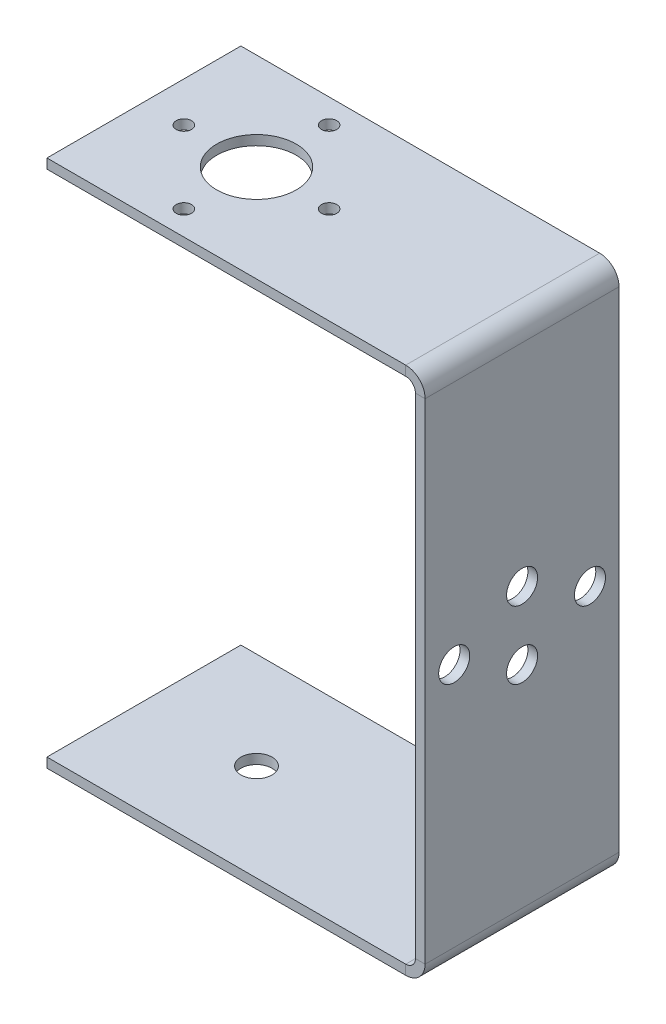
ISO-10303-21;
HEADER;
FILE_DESCRIPTION(('STEP AP214'),'2;1');
FILE_NAME('part.step','',(''),(''),'','','');
FILE_SCHEMA(('AUTOMOTIVE_DESIGN { 1 0 10303 214 1 1 1 1 }'));
ENDSEC;
DATA;
#1=APPLICATION_CONTEXT('core data for automotive mechanical design processes');
#2=APPLICATION_PROTOCOL_DEFINITION('international standard','automotive_design',2000,#1);
#3=PRODUCT_CONTEXT('',#1,'mechanical');
#4=PRODUCT('Part','Part','',(#3));
#5=PRODUCT_RELATED_PRODUCT_CATEGORY('part','',(#4));
#6=PRODUCT_DEFINITION_FORMATION('','',#4);
#7=PRODUCT_DEFINITION_CONTEXT('part definition',#1,'design');
#8=PRODUCT_DEFINITION('design','',#6,#7);
#9=PRODUCT_DEFINITION_SHAPE('','',#8);
#10=(LENGTH_UNIT() NAMED_UNIT(*) SI_UNIT(.MILLI.,.METRE.));
#11=(NAMED_UNIT(*) PLANE_ANGLE_UNIT() SI_UNIT($,.RADIAN.));
#12=(NAMED_UNIT(*) SI_UNIT($,.STERADIAN.) SOLID_ANGLE_UNIT());
#13=UNCERTAINTY_MEASURE_WITH_UNIT(LENGTH_MEASURE(1.E-05),#10,'distance_accuracy_value','');
#14=(GEOMETRIC_REPRESENTATION_CONTEXT(3) GLOBAL_UNCERTAINTY_ASSIGNED_CONTEXT((#13)) GLOBAL_UNIT_ASSIGNED_CONTEXT((#10,
#11,#12)) REPRESENTATION_CONTEXT('',''));
#15=CARTESIAN_POINT('',(0.,0.,0.));
#16=DIRECTION('',(0.,0.,1.));
#17=DIRECTION('',(1.,0.,0.));
#18=AXIS2_PLACEMENT_3D('',#15,#16,#17);
#19=CARTESIAN_POINT('',(-26.39,1.,-10.));
#20=DIRECTION('',(0.,-1.,0.));
#21=DIRECTION('',(0.,0.,-1.));
#22=AXIS2_PLACEMENT_3D('',#19,#20,#21);
#23=CYLINDRICAL_SURFACE('',#22,1.6);
#24=CARTESIAN_POINT('',(-26.39,1.,-10.));
#25=DIRECTION('',(0.,-1.,0.));
#26=DIRECTION('',(0.,0.,-1.));
#27=AXIS2_PLACEMENT_3D('',#24,#25,#26);
#28=CIRCLE('',#27,1.6);
#29=CARTESIAN_POINT('',(-26.39,1.,-11.6));
#30=VERTEX_POINT('',#29);
#31=EDGE_CURVE('E256',#30,#30,#28,.T.);
#32=ORIENTED_EDGE('',*,*,#31,.F.);
#33=EDGE_LOOP('',(#32));
#34=FACE_BOUND('',#33,.T.);
#35=CARTESIAN_POINT('',(-26.39,0.,-10.));
#36=DIRECTION('',(0.,-1.,0.));
#37=DIRECTION('',(0.,0.,-1.));
#38=AXIS2_PLACEMENT_3D('',#35,#36,#37);
#39=CIRCLE('',#38,1.6);
#40=CARTESIAN_POINT('',(-26.39,0.,-11.6));
#41=VERTEX_POINT('',#40);
#42=EDGE_CURVE('E184',#41,#41,#39,.T.);
#43=ORIENTED_EDGE('',*,*,#42,.T.);
#44=EDGE_LOOP('',(#43));
#45=FACE_BOUND('',#44,.T.);
#46=ADVANCED_FACE('F35',(#34,#45),#23,.F.);
#47=CARTESIAN_POINT('',(-38.,85.1189633792524,0.));
#48=DIRECTION('',(-1.,0.,0.));
#49=DIRECTION('',(0.,0.,-1.));
#50=AXIS2_PLACEMENT_3D('',#47,#48,#49);
#51=PLANE('',#50);
#52=DIRECTION('',(0.,0.,1.));
#53=VECTOR('',#52,1.);
#54=CARTESIAN_POINT('',(-38.,0.,0.));
#55=LINE('',#54,#53);
#56=CARTESIAN_POINT('',(-38.,0.,-20.));
#57=VERTEX_POINT('',#56);
#58=CARTESIAN_POINT('',(-38.,0.,0.));
#59=VERTEX_POINT('',#58);
#60=EDGE_CURVE('E69',#57,#59,#55,.T.);
#61=ORIENTED_EDGE('',*,*,#60,.T.);
#62=DIRECTION('',(0.,-1.,0.));
#63=VECTOR('',#62,1.);
#64=CARTESIAN_POINT('',(-38.,85.1189633792524,0.));
#65=LINE('',#64,#63);
#66=CARTESIAN_POINT('',(-38.,0.999999999999997,0.));
#67=VERTEX_POINT('',#66);
#68=EDGE_CURVE('E157',#67,#59,#65,.T.);
#69=ORIENTED_EDGE('',*,*,#68,.F.);
#70=DIRECTION('',(0.,0.,-1.));
#71=VECTOR('',#70,1.);
#72=CARTESIAN_POINT('',(-38.,1.,0.));
#73=LINE('',#72,#71);
#74=CARTESIAN_POINT('',(-38.,0.999999999999997,-20.));
#75=VERTEX_POINT('',#74);
#76=EDGE_CURVE('E54',#67,#75,#73,.T.);
#77=ORIENTED_EDGE('',*,*,#76,.T.);
#78=DIRECTION('',(0.,-1.,0.));
#79=VECTOR('',#78,1.);
#80=CARTESIAN_POINT('',(-38.,85.1189633792524,-20.));
#81=LINE('',#80,#79);
#82=EDGE_CURVE('E174',#75,#57,#81,.T.);
#83=ORIENTED_EDGE('',*,*,#82,.T.);
#84=EDGE_LOOP('',(#61,#69,#77,#83));
#85=FACE_BOUND('',#84,.T.);
#86=ADVANCED_FACE('F264',(#85),#51,.T.);
#87=CARTESIAN_POINT('',(-38.,85.1189633792524,-20.));
#88=DIRECTION('',(0.,0.,-1.));
#89=DIRECTION('',(1.,0.,0.));
#90=AXIS2_PLACEMENT_3D('',#87,#88,#89);
#91=PLANE('',#90);
#92=DIRECTION('',(-1.,0.,0.));
#93=VECTOR('',#92,1.);
#94=CARTESIAN_POINT('',(1.,0.,-20.));
#95=LINE('',#94,#93);
#96=CARTESIAN_POINT('',(-0.999999999999993,0.,-20.));
#97=VERTEX_POINT('',#96);
#98=EDGE_CURVE('E168',#97,#57,#95,.T.);
#99=ORIENTED_EDGE('',*,*,#98,.T.);
#100=ORIENTED_EDGE('',*,*,#82,.F.);
#101=DIRECTION('',(1.,0.,0.));
#102=VECTOR('',#101,1.);
#103=CARTESIAN_POINT('',(-38.,0.999999999999997,-20.));
#104=LINE('',#103,#102);
#105=CARTESIAN_POINT('',(-0.999999999999997,0.999999999999997,-20.));
#106=VERTEX_POINT('',#105);
#107=EDGE_CURVE('E173',#75,#106,#104,.T.);
#108=ORIENTED_EDGE('',*,*,#107,.T.);
#109=DIRECTION('',(0.,-1.,0.));
#110=VECTOR('',#109,1.);
#111=CARTESIAN_POINT('',(-1.,85.1189633792524,-20.));
#112=LINE('',#111,#110);
#113=EDGE_CURVE('E158',#106,#97,#112,.T.);
#114=ORIENTED_EDGE('',*,*,#113,.T.);
#115=EDGE_LOOP('',(#99,#100,#108,#114));
#116=FACE_BOUND('',#115,.T.);
#117=ADVANCED_FACE('F177',(#116),#91,.T.);
#118=CARTESIAN_POINT('',(1.,0.,0.));
#119=DIRECTION('',(0.,1.,0.));
#120=DIRECTION('',(0.,0.,1.));
#121=AXIS2_PLACEMENT_3D('',#118,#119,#120);
#122=PLANE('',#121);
#123=ORIENTED_EDGE('',*,*,#42,.F.);
#124=EDGE_LOOP('',(#123));
#125=FACE_BOUND('',#124,.T.);
#126=ORIENTED_EDGE('',*,*,#98,.F.);
#127=DIRECTION('',(0.,0.,1.));
#128=VECTOR('',#127,1.);
#129=CARTESIAN_POINT('',(-1.,0.,-20.));
#130=LINE('',#129,#128);
#131=CARTESIAN_POINT('',(-1.,0.,0.));
#132=VERTEX_POINT('',#131);
#133=EDGE_CURVE('E151',#97,#132,#130,.T.);
#134=ORIENTED_EDGE('',*,*,#133,.T.);
#135=DIRECTION('',(1.,0.,0.));
#136=VECTOR('',#135,1.);
#137=CARTESIAN_POINT('',(-38.,0.,0.));
#138=LINE('',#137,#136);
#139=EDGE_CURVE('E74',#59,#132,#138,.T.);
#140=ORIENTED_EDGE('',*,*,#139,.F.);
#141=ORIENTED_EDGE('',*,*,#60,.F.);
#142=EDGE_LOOP('',(#126,#134,#140,#141));
#143=FACE_BOUND('',#142,.T.);
#144=ADVANCED_FACE('F169',(#125,#143),#122,.F.);
#145=CARTESIAN_POINT('',(-38.,85.1189633792524,0.));
#146=DIRECTION('',(0.,0.,-1.));
#147=DIRECTION('',(1.,0.,0.));
#148=AXIS2_PLACEMENT_3D('',#145,#146,#147);
#149=PLANE('',#148);
#150=ORIENTED_EDGE('',*,*,#68,.T.);
#151=ORIENTED_EDGE('',*,*,#139,.T.);
#152=DIRECTION('',(0.,-1.,0.));
#153=VECTOR('',#152,1.);
#154=CARTESIAN_POINT('',(-1.,85.1189633792524,0.));
#155=LINE('',#154,#153);
#156=CARTESIAN_POINT('',(-0.999999999999998,1.,0.));
#157=VERTEX_POINT('',#156);
#158=EDGE_CURVE('E39',#157,#132,#155,.T.);
#159=ORIENTED_EDGE('',*,*,#158,.F.);
#160=DIRECTION('',(1.,0.,0.));
#161=VECTOR('',#160,1.);
#162=CARTESIAN_POINT('',(-38.,1.,0.));
#163=LINE('',#162,#161);
#164=EDGE_CURVE('E45',#67,#157,#163,.T.);
#165=ORIENTED_EDGE('',*,*,#164,.F.);
#166=EDGE_LOOP('',(#150,#151,#159,#165));
#167=FACE_BOUND('',#166,.T.);
#168=ADVANCED_FACE('F262',(#167),#149,.F.);
#169=CARTESIAN_POINT('',(-38.,1.,0.));
#170=DIRECTION('',(0.,-1.,0.));
#171=DIRECTION('',(0.,0.,-1.));
#172=AXIS2_PLACEMENT_3D('',#169,#170,#171);
#173=PLANE('',#172);
#174=ORIENTED_EDGE('',*,*,#31,.T.);
#175=EDGE_LOOP('',(#174));
#176=FACE_BOUND('',#175,.T.);
#177=ORIENTED_EDGE('',*,*,#164,.T.);
#178=DIRECTION('',(0.,0.,-1.));
#179=VECTOR('',#178,1.);
#180=CARTESIAN_POINT('',(-1.,0.999999999999997,-20.));
#181=LINE('',#180,#179);
#182=EDGE_CURVE('E11',#157,#106,#181,.T.);
#183=ORIENTED_EDGE('',*,*,#182,.T.);
#184=ORIENTED_EDGE('',*,*,#107,.F.);
#185=ORIENTED_EDGE('',*,*,#76,.F.);
#186=EDGE_LOOP('',(#177,#183,#184,#185));
#187=FACE_BOUND('',#186,.T.);
#188=ADVANCED_FACE('F37',(#176,#187),#173,.F.);
#189=CARTESIAN_POINT('',(-26.39,53.5,-10.));
#190=DIRECTION('',(0.,1.,0.));
#191=DIRECTION('',(0.,0.,1.));
#192=AXIS2_PLACEMENT_3D('',#189,#190,#191);
#193=CYLINDRICAL_SURFACE('',#192,4.1);
#194=CARTESIAN_POINT('',(-26.39,53.5,-10.));
#195=DIRECTION('',(0.,1.,0.));
#196=DIRECTION('',(0.,0.,1.));
#197=AXIS2_PLACEMENT_3D('',#194,#195,#196);
#198=CIRCLE('',#197,4.1);
#199=CARTESIAN_POINT('',(-26.39,53.5,-5.9));
#200=VERTEX_POINT('',#199);
#201=EDGE_CURVE('E196',#200,#200,#198,.T.);
#202=ORIENTED_EDGE('',*,*,#201,.F.);
#203=EDGE_LOOP('',(#202));
#204=FACE_BOUND('',#203,.T.);
#205=CARTESIAN_POINT('',(-26.39,54.5,-10.));
#206=DIRECTION('',(0.,1.,0.));
#207=DIRECTION('',(0.,0.,1.));
#208=AXIS2_PLACEMENT_3D('',#205,#206,#207);
#209=CIRCLE('',#208,4.1);
#210=CARTESIAN_POINT('',(-26.39,54.5,-5.9));
#211=VERTEX_POINT('',#210);
#212=EDGE_CURVE('E249',#211,#211,#209,.T.);
#213=ORIENTED_EDGE('',*,*,#212,.T.);
#214=EDGE_LOOP('',(#213));
#215=FACE_BOUND('',#214,.T.);
#216=ADVANCED_FACE('F284',(#204,#215),#193,.F.);
#217=CARTESIAN_POINT('',(-33.88,53.5,-10.));
#218=DIRECTION('',(0.,1.,0.));
#219=DIRECTION('',(0.,0.,1.));
#220=AXIS2_PLACEMENT_3D('',#217,#218,#219);
#221=CYLINDRICAL_SURFACE('',#220,0.789999999999999);
#222=CARTESIAN_POINT('',(-33.88,53.5,-10.));
#223=DIRECTION('',(0.,1.,0.));
#224=DIRECTION('',(0.,0.,1.));
#225=AXIS2_PLACEMENT_3D('',#222,#223,#224);
#226=CIRCLE('',#225,0.789999999999999);
#227=CARTESIAN_POINT('',(-33.88,53.5,-9.21));
#228=VERTEX_POINT('',#227);
#229=EDGE_CURVE('E205',#228,#228,#226,.T.);
#230=ORIENTED_EDGE('',*,*,#229,.F.);
#231=EDGE_LOOP('',(#230));
#232=FACE_BOUND('',#231,.T.);
#233=CARTESIAN_POINT('',(-33.88,54.5,-10.));
#234=DIRECTION('',(0.,1.,0.));
#235=DIRECTION('',(0.,0.,1.));
#236=AXIS2_PLACEMENT_3D('',#233,#234,#235);
#237=CIRCLE('',#236,0.789999999999999);
#238=CARTESIAN_POINT('',(-33.88,54.5,-9.21));
#239=VERTEX_POINT('',#238);
#240=EDGE_CURVE('E246',#239,#239,#237,.T.);
#241=ORIENTED_EDGE('',*,*,#240,.T.);
#242=EDGE_LOOP('',(#241));
#243=FACE_BOUND('',#242,.T.);
#244=ADVANCED_FACE('F289',(#232,#243),#221,.F.);
#245=CARTESIAN_POINT('',(-18.9,53.5,-10.));
#246=DIRECTION('',(0.,1.,0.));
#247=DIRECTION('',(0.,0.,1.));
#248=AXIS2_PLACEMENT_3D('',#245,#246,#247);
#249=CYLINDRICAL_SURFACE('',#248,0.790000000000002);
#250=CARTESIAN_POINT('',(-18.9,53.5,-10.));
#251=DIRECTION('',(0.,1.,0.));
#252=DIRECTION('',(0.,0.,1.));
#253=AXIS2_PLACEMENT_3D('',#250,#251,#252);
#254=CIRCLE('',#253,0.790000000000002);
#255=CARTESIAN_POINT('',(-18.9,53.5,-9.21));
#256=VERTEX_POINT('',#255);
#257=EDGE_CURVE('E208',#256,#256,#254,.T.);
#258=ORIENTED_EDGE('',*,*,#257,.F.);
#259=EDGE_LOOP('',(#258));
#260=FACE_BOUND('',#259,.T.);
#261=CARTESIAN_POINT('',(-18.9,54.5,-10.));
#262=DIRECTION('',(0.,1.,0.));
#263=DIRECTION('',(0.,0.,1.));
#264=AXIS2_PLACEMENT_3D('',#261,#262,#263);
#265=CIRCLE('',#264,0.790000000000002);
#266=CARTESIAN_POINT('',(-18.9,54.5,-9.21));
#267=VERTEX_POINT('',#266);
#268=EDGE_CURVE('E243',#267,#267,#265,.T.);
#269=ORIENTED_EDGE('',*,*,#268,.T.);
#270=EDGE_LOOP('',(#269));
#271=FACE_BOUND('',#270,.T.);
#272=ADVANCED_FACE('F430',(#260,#271),#249,.F.);
#273=CARTESIAN_POINT('',(-26.39,53.5,-2.51));
#274=DIRECTION('',(0.,1.,0.));
#275=DIRECTION('',(0.,0.,1.));
#276=AXIS2_PLACEMENT_3D('',#273,#274,#275);
#277=CYLINDRICAL_SURFACE('',#276,0.789999999999999);
#278=CARTESIAN_POINT('',(-26.39,53.5,-2.51));
#279=DIRECTION('',(0.,1.,0.));
#280=DIRECTION('',(0.,0.,1.));
#281=AXIS2_PLACEMENT_3D('',#278,#279,#280);
#282=CIRCLE('',#281,0.789999999999999);
#283=CARTESIAN_POINT('',(-26.39,53.5,-1.72));
#284=VERTEX_POINT('',#283);
#285=EDGE_CURVE('E211',#284,#284,#282,.T.);
#286=ORIENTED_EDGE('',*,*,#285,.F.);
#287=EDGE_LOOP('',(#286));
#288=FACE_BOUND('',#287,.T.);
#289=CARTESIAN_POINT('',(-26.39,54.5,-2.51));
#290=DIRECTION('',(0.,1.,0.));
#291=DIRECTION('',(0.,0.,1.));
#292=AXIS2_PLACEMENT_3D('',#289,#290,#291);
#293=CIRCLE('',#292,0.789999999999999);
#294=CARTESIAN_POINT('',(-26.39,54.5,-1.72));
#295=VERTEX_POINT('',#294);
#296=EDGE_CURVE('E240',#295,#295,#293,.T.);
#297=ORIENTED_EDGE('',*,*,#296,.T.);
#298=EDGE_LOOP('',(#297));
#299=FACE_BOUND('',#298,.T.);
#300=ADVANCED_FACE('F398',(#288,#299),#277,.F.);
#301=CARTESIAN_POINT('',(-26.39,53.5,-17.49));
#302=DIRECTION('',(0.,1.,0.));
#303=DIRECTION('',(0.,0.,1.));
#304=AXIS2_PLACEMENT_3D('',#301,#302,#303);
#305=CYLINDRICAL_SURFACE('',#304,0.789999999999999);
#306=CARTESIAN_POINT('',(-26.39,53.5,-17.49));
#307=DIRECTION('',(0.,1.,0.));
#308=DIRECTION('',(0.,0.,1.));
#309=AXIS2_PLACEMENT_3D('',#306,#307,#308);
#310=CIRCLE('',#309,0.789999999999999);
#311=CARTESIAN_POINT('',(-26.39,53.5,-16.7));
#312=VERTEX_POINT('',#311);
#313=EDGE_CURVE('E214',#312,#312,#310,.T.);
#314=ORIENTED_EDGE('',*,*,#313,.F.);
#315=EDGE_LOOP('',(#314));
#316=FACE_BOUND('',#315,.T.);
#317=CARTESIAN_POINT('',(-26.39,54.5,-17.49));
#318=DIRECTION('',(0.,1.,0.));
#319=DIRECTION('',(0.,0.,1.));
#320=AXIS2_PLACEMENT_3D('',#317,#318,#319);
#321=CIRCLE('',#320,0.789999999999999);
#322=CARTESIAN_POINT('',(-26.39,54.5,-16.7));
#323=VERTEX_POINT('',#322);
#324=EDGE_CURVE('E237',#323,#323,#321,.T.);
#325=ORIENTED_EDGE('',*,*,#324,.T.);
#326=EDGE_LOOP('',(#325));
#327=FACE_BOUND('',#326,.T.);
#328=ADVANCED_FACE('F391',(#316,#327),#305,.F.);
#329=CARTESIAN_POINT('',(-38.,-30.6189633792523,-20.));
#330=DIRECTION('',(-1.,0.,0.));
#331=DIRECTION('',(0.,-1.,0.));
#332=AXIS2_PLACEMENT_3D('',#329,#330,#331);
#333=PLANE('',#332);
#334=DIRECTION('',(0.,0.,-1.));
#335=VECTOR('',#334,1.);
#336=CARTESIAN_POINT('',(-38.,54.5,-20.));
#337=LINE('',#336,#335);
#338=CARTESIAN_POINT('',(-38.,54.5,0.));
#339=VERTEX_POINT('',#338);
#340=CARTESIAN_POINT('',(-38.,54.5,-20.));
#341=VERTEX_POINT('',#340);
#342=EDGE_CURVE('E97',#339,#341,#337,.T.);
#343=ORIENTED_EDGE('',*,*,#342,.T.);
#344=DIRECTION('',(0.,1.,0.));
#345=VECTOR('',#344,1.);
#346=CARTESIAN_POINT('',(-38.,-30.6189633792523,-20.));
#347=LINE('',#346,#345);
#348=CARTESIAN_POINT('',(-38.,53.5,-20.));
#349=VERTEX_POINT('',#348);
#350=EDGE_CURVE('E218',#349,#341,#347,.T.);
#351=ORIENTED_EDGE('',*,*,#350,.F.);
#352=DIRECTION('',(0.,0.,1.));
#353=VECTOR('',#352,1.);
#354=CARTESIAN_POINT('',(-38.,53.5,-20.));
#355=LINE('',#354,#353);
#356=CARTESIAN_POINT('',(-38.,53.5,0.));
#357=VERTEX_POINT('',#356);
#358=EDGE_CURVE('E82',#349,#357,#355,.T.);
#359=ORIENTED_EDGE('',*,*,#358,.T.);
#360=DIRECTION('',(0.,1.,0.));
#361=VECTOR('',#360,1.);
#362=CARTESIAN_POINT('',(-38.,-30.6189633792523,0.));
#363=LINE('',#362,#361);
#364=EDGE_CURVE('E232',#357,#339,#363,.T.);
#365=ORIENTED_EDGE('',*,*,#364,.T.);
#366=EDGE_LOOP('',(#343,#351,#359,#365));
#367=FACE_BOUND('',#366,.T.);
#368=ADVANCED_FACE('F390',(#367),#333,.T.);
#369=CARTESIAN_POINT('',(-38.,-30.6189633792523,0.));
#370=DIRECTION('',(0.,0.,1.));
#371=DIRECTION('',(0.,1.,0.));
#372=AXIS2_PLACEMENT_3D('',#369,#370,#371);
#373=PLANE('',#372);
#374=DIRECTION('',(-1.,0.,0.));
#375=VECTOR('',#374,1.);
#376=CARTESIAN_POINT('',(1.,54.5,0.));
#377=LINE('',#376,#375);
#378=CARTESIAN_POINT('',(-0.999999999999997,54.5,0.));
#379=VERTEX_POINT('',#378);
#380=EDGE_CURVE('E228',#379,#339,#377,.T.);
#381=ORIENTED_EDGE('',*,*,#380,.T.);
#382=ORIENTED_EDGE('',*,*,#364,.F.);
#383=DIRECTION('',(1.,0.,0.));
#384=VECTOR('',#383,1.);
#385=CARTESIAN_POINT('',(-38.,53.5,0.));
#386=LINE('',#385,#384);
#387=CARTESIAN_POINT('',(-0.999999999999999,53.5,0.));
#388=VERTEX_POINT('',#387);
#389=EDGE_CURVE('E226',#357,#388,#386,.T.);
#390=ORIENTED_EDGE('',*,*,#389,.T.);
#391=DIRECTION('',(0.,1.,0.));
#392=VECTOR('',#391,1.);
#393=CARTESIAN_POINT('',(-1.00000000000001,-30.6189633792523,0.));
#394=LINE('',#393,#392);
#395=EDGE_CURVE('E223',#388,#379,#394,.T.);
#396=ORIENTED_EDGE('',*,*,#395,.T.);
#397=EDGE_LOOP('',(#381,#382,#390,#396));
#398=FACE_BOUND('',#397,.T.);
#399=ADVANCED_FACE('F387',(#398),#373,.T.);
#400=CARTESIAN_POINT('',(1.,54.5,0.));
#401=DIRECTION('',(0.,-1.,0.));
#402=DIRECTION('',(0.,0.,-1.));
#403=AXIS2_PLACEMENT_3D('',#400,#401,#402);
#404=PLANE('',#403);
#405=ORIENTED_EDGE('',*,*,#324,.F.);
#406=EDGE_LOOP('',(#405));
#407=FACE_BOUND('',#406,.T.);
#408=ORIENTED_EDGE('',*,*,#296,.F.);
#409=EDGE_LOOP('',(#408));
#410=FACE_BOUND('',#409,.T.);
#411=ORIENTED_EDGE('',*,*,#268,.F.);
#412=EDGE_LOOP('',(#411));
#413=FACE_BOUND('',#412,.T.);
#414=ORIENTED_EDGE('',*,*,#240,.F.);
#415=EDGE_LOOP('',(#414));
#416=FACE_BOUND('',#415,.T.);
#417=ORIENTED_EDGE('',*,*,#212,.F.);
#418=EDGE_LOOP('',(#417));
#419=FACE_BOUND('',#418,.T.);
#420=ORIENTED_EDGE('',*,*,#380,.F.);
#421=DIRECTION('',(0.,0.,-1.));
#422=VECTOR('',#421,1.);
#423=CARTESIAN_POINT('',(-1.00000000000001,54.5,0.));
#424=LINE('',#423,#422);
#425=CARTESIAN_POINT('',(-1.,54.5,-20.));
#426=VERTEX_POINT('',#425);
#427=EDGE_CURVE('E221',#379,#426,#424,.T.);
#428=ORIENTED_EDGE('',*,*,#427,.T.);
#429=DIRECTION('',(1.,0.,0.));
#430=VECTOR('',#429,1.);
#431=CARTESIAN_POINT('',(-38.,54.5,-20.));
#432=LINE('',#431,#430);
#433=EDGE_CURVE('E101',#341,#426,#432,.T.);
#434=ORIENTED_EDGE('',*,*,#433,.F.);
#435=ORIENTED_EDGE('',*,*,#342,.F.);
#436=EDGE_LOOP('',(#420,#428,#434,#435));
#437=FACE_BOUND('',#436,.T.);
#438=ADVANCED_FACE('F384',(#407,#410,#413,#416,#419,#437),#404,.F.);
#439=CARTESIAN_POINT('',(-38.,-30.6189633792523,-20.));
#440=DIRECTION('',(0.,0.,1.));
#441=DIRECTION('',(0.,1.,0.));
#442=AXIS2_PLACEMENT_3D('',#439,#440,#441);
#443=PLANE('',#442);
#444=ORIENTED_EDGE('',*,*,#350,.T.);
#445=ORIENTED_EDGE('',*,*,#433,.T.);
#446=DIRECTION('',(0.,1.,0.));
#447=VECTOR('',#446,1.);
#448=CARTESIAN_POINT('',(-1.00000000000001,-30.6189633792523,-20.));
#449=LINE('',#448,#447);
#450=CARTESIAN_POINT('',(-0.999999999999999,53.5,-20.));
#451=VERTEX_POINT('',#450);
#452=EDGE_CURVE('E252',#451,#426,#449,.T.);
#453=ORIENTED_EDGE('',*,*,#452,.F.);
#454=DIRECTION('',(1.,0.,0.));
#455=VECTOR('',#454,1.);
#456=CARTESIAN_POINT('',(-38.,53.5,-20.));
#457=LINE('',#456,#455);
#458=EDGE_CURVE('E193',#349,#451,#457,.T.);
#459=ORIENTED_EDGE('',*,*,#458,.F.);
#460=EDGE_LOOP('',(#444,#445,#453,#459));
#461=FACE_BOUND('',#460,.T.);
#462=ADVANCED_FACE('F382',(#461),#443,.F.);
#463=CARTESIAN_POINT('',(-38.,53.5,-20.));
#464=DIRECTION('',(0.,1.,0.));
#465=DIRECTION('',(0.,0.,1.));
#466=AXIS2_PLACEMENT_3D('',#463,#464,#465);
#467=PLANE('',#466);
#468=ORIENTED_EDGE('',*,*,#313,.T.);
#469=EDGE_LOOP('',(#468));
#470=FACE_BOUND('',#469,.T.);
#471=ORIENTED_EDGE('',*,*,#285,.T.);
#472=EDGE_LOOP('',(#471));
#473=FACE_BOUND('',#472,.T.);
#474=ORIENTED_EDGE('',*,*,#257,.T.);
#475=EDGE_LOOP('',(#474));
#476=FACE_BOUND('',#475,.T.);
#477=ORIENTED_EDGE('',*,*,#229,.T.);
#478=EDGE_LOOP('',(#477));
#479=FACE_BOUND('',#478,.T.);
#480=ORIENTED_EDGE('',*,*,#201,.T.);
#481=EDGE_LOOP('',(#480));
#482=FACE_BOUND('',#481,.T.);
#483=ORIENTED_EDGE('',*,*,#458,.T.);
#484=DIRECTION('',(0.,0.,1.));
#485=VECTOR('',#484,1.);
#486=CARTESIAN_POINT('',(-1.00000000000001,53.5,0.));
#487=LINE('',#486,#485);
#488=EDGE_CURVE('E188',#451,#388,#487,.T.);
#489=ORIENTED_EDGE('',*,*,#488,.T.);
#490=ORIENTED_EDGE('',*,*,#389,.F.);
#491=ORIENTED_EDGE('',*,*,#358,.F.);
#492=EDGE_LOOP('',(#483,#489,#490,#491));
#493=FACE_BOUND('',#492,.T.);
#494=ADVANCED_FACE('F388',(#470,#473,#476,#479,#482,#493),#467,.F.);
#495=CARTESIAN_POINT('',(1.,0.,0.));
#496=DIRECTION('',(-1.,0.,0.));
#497=DIRECTION('',(0.,0.,1.));
#498=AXIS2_PLACEMENT_3D('',#495,#496,#497);
#499=PLANE('',#498);
#500=CARTESIAN_POINT('',(1.,30.75,-10.));
#501=DIRECTION('',(1.,0.,0.));
#502=DIRECTION('',(0.,0.,-1.));
#503=AXIS2_PLACEMENT_3D('',#500,#501,#502);
#504=CIRCLE('',#503,1.6);
#505=CARTESIAN_POINT('',(1.,30.75,-11.6));
#506=VERTEX_POINT('',#505);
#507=EDGE_CURVE('E340',#506,#506,#504,.T.);
#508=ORIENTED_EDGE('',*,*,#507,.F.);
#509=EDGE_LOOP('',(#508));
#510=FACE_BOUND('',#509,.T.);
#511=CARTESIAN_POINT('',(1.,23.75,-10.));
#512=DIRECTION('',(1.,0.,0.));
#513=DIRECTION('',(0.,0.,-1.));
#514=AXIS2_PLACEMENT_3D('',#511,#512,#513);
#515=CIRCLE('',#514,1.6);
#516=CARTESIAN_POINT('',(1.,23.75,-11.6));
#517=VERTEX_POINT('',#516);
#518=EDGE_CURVE('E775',#517,#517,#515,.T.);
#519=ORIENTED_EDGE('',*,*,#518,.F.);
#520=EDGE_LOOP('',(#519));
#521=FACE_BOUND('',#520,.T.);
#522=CARTESIAN_POINT('',(1.,27.25,-3.00000000000002));
#523=DIRECTION('',(1.,0.,0.));
#524=DIRECTION('',(0.,0.,-1.));
#525=AXIS2_PLACEMENT_3D('',#522,#523,#524);
#526=CIRCLE('',#525,1.6);
#527=CARTESIAN_POINT('',(1.,27.25,-4.60000000000002));
#528=VERTEX_POINT('',#527);
#529=EDGE_CURVE('E772',#528,#528,#526,.T.);
#530=ORIENTED_EDGE('',*,*,#529,.F.);
#531=EDGE_LOOP('',(#530));
#532=FACE_BOUND('',#531,.T.);
#533=CARTESIAN_POINT('',(1.,27.25,-17.));
#534=DIRECTION('',(1.,0.,0.));
#535=DIRECTION('',(0.,0.,-1.));
#536=AXIS2_PLACEMENT_3D('',#533,#534,#535);
#537=CIRCLE('',#536,1.6);
#538=CARTESIAN_POINT('',(1.,27.25,-18.6));
#539=VERTEX_POINT('',#538);
#540=EDGE_CURVE('E770',#539,#539,#537,.T.);
#541=ORIENTED_EDGE('',*,*,#540,.F.);
#542=EDGE_LOOP('',(#541));
#543=FACE_BOUND('',#542,.T.);
#544=DIRECTION('',(0.,0.,1.));
#545=VECTOR('',#544,1.);
#546=CARTESIAN_POINT('',(1.,2.,-20.));
#547=LINE('',#546,#545);
#548=CARTESIAN_POINT('',(1.,2.,-20.));
#549=VERTEX_POINT('',#548);
#550=CARTESIAN_POINT('',(1.,2.,0.));
#551=VERTEX_POINT('',#550);
#552=EDGE_CURVE('E114',#549,#551,#547,.T.);
#553=ORIENTED_EDGE('',*,*,#552,.F.);
#554=DIRECTION('',(0.,1.,0.));
#555=VECTOR('',#554,1.);
#556=CARTESIAN_POINT('',(1.,0.,-20.));
#557=LINE('',#556,#555);
#558=CARTESIAN_POINT('',(1.,52.5,-20.));
#559=VERTEX_POINT('',#558);
#560=EDGE_CURVE('E337',#549,#559,#557,.T.);
#561=ORIENTED_EDGE('',*,*,#560,.T.);
#562=DIRECTION('',(0.,0.,-1.));
#563=VECTOR('',#562,1.);
#564=CARTESIAN_POINT('',(1.,52.5,0.));
#565=LINE('',#564,#563);
#566=CARTESIAN_POINT('',(1.,52.5,0.));
#567=VERTEX_POINT('',#566);
#568=EDGE_CURVE('E107',#567,#559,#565,.T.);
#569=ORIENTED_EDGE('',*,*,#568,.F.);
#570=DIRECTION('',(0.,-1.,0.));
#571=VECTOR('',#570,1.);
#572=CARTESIAN_POINT('',(1.,0.,0.));
#573=LINE('',#572,#571);
#574=EDGE_CURVE('E367',#567,#551,#573,.T.);
#575=ORIENTED_EDGE('',*,*,#574,.T.);
#576=EDGE_LOOP('',(#553,#561,#569,#575));
#577=FACE_BOUND('',#576,.T.);
#578=ADVANCED_FACE('F374',(#510,#521,#532,#543,#577),#499,.F.);
#579=CARTESIAN_POINT('',(0.,0.,0.));
#580=DIRECTION('',(-1.,0.,0.));
#581=DIRECTION('',(0.,0.,1.));
#582=AXIS2_PLACEMENT_3D('',#579,#580,#581);
#583=PLANE('',#582);
#584=CARTESIAN_POINT('',(0.,30.75,-10.));
#585=DIRECTION('',(-1.,0.,0.));
#586=DIRECTION('',(0.,0.,1.));
#587=AXIS2_PLACEMENT_3D('',#584,#585,#586);
#588=CIRCLE('',#587,1.6);
#589=CARTESIAN_POINT('',(0.,30.75,-8.4));
#590=VERTEX_POINT('',#589);
#591=EDGE_CURVE('E311',#590,#590,#588,.F.);
#592=ORIENTED_EDGE('',*,*,#591,.T.);
#593=EDGE_LOOP('',(#592));
#594=FACE_BOUND('',#593,.T.);
#595=CARTESIAN_POINT('',(0.,23.75,-10.));
#596=DIRECTION('',(-1.,0.,0.));
#597=DIRECTION('',(0.,0.,1.));
#598=AXIS2_PLACEMENT_3D('',#595,#596,#597);
#599=CIRCLE('',#598,1.6);
#600=CARTESIAN_POINT('',(0.,23.75,-8.40000000000001));
#601=VERTEX_POINT('',#600);
#602=EDGE_CURVE('E318',#601,#601,#599,.F.);
#603=ORIENTED_EDGE('',*,*,#602,.T.);
#604=EDGE_LOOP('',(#603));
#605=FACE_BOUND('',#604,.T.);
#606=CARTESIAN_POINT('',(0.,27.25,-3.00000000000002));
#607=DIRECTION('',(-1.,0.,0.));
#608=DIRECTION('',(0.,0.,1.));
#609=AXIS2_PLACEMENT_3D('',#606,#607,#608);
#610=CIRCLE('',#609,1.6);
#611=CARTESIAN_POINT('',(0.,27.25,-1.40000000000002));
#612=VERTEX_POINT('',#611);
#613=EDGE_CURVE('E321',#612,#612,#610,.F.);
#614=ORIENTED_EDGE('',*,*,#613,.T.);
#615=EDGE_LOOP('',(#614));
#616=FACE_BOUND('',#615,.T.);
#617=CARTESIAN_POINT('',(0.,27.25,-17.));
#618=DIRECTION('',(-1.,0.,0.));
#619=DIRECTION('',(0.,0.,1.));
#620=AXIS2_PLACEMENT_3D('',#617,#618,#619);
#621=CIRCLE('',#620,1.6);
#622=CARTESIAN_POINT('',(0.,27.25,-15.4));
#623=VERTEX_POINT('',#622);
#624=EDGE_CURVE('E324',#623,#623,#621,.F.);
#625=ORIENTED_EDGE('',*,*,#624,.T.);
#626=EDGE_LOOP('',(#625));
#627=FACE_BOUND('',#626,.T.);
#628=DIRECTION('',(0.,1.,0.));
#629=VECTOR('',#628,1.);
#630=CARTESIAN_POINT('',(0.,0.,-20.));
#631=LINE('',#630,#629);
#632=CARTESIAN_POINT('',(0.,2.,-20.));
#633=VERTEX_POINT('',#632);
#634=CARTESIAN_POINT('',(0.,52.5,-20.));
#635=VERTEX_POINT('',#634);
#636=EDGE_CURVE('E327',#633,#635,#631,.T.);
#637=ORIENTED_EDGE('',*,*,#636,.F.);
#638=DIRECTION('',(0.,0.,1.));
#639=VECTOR('',#638,1.);
#640=CARTESIAN_POINT('',(0.,2.,-20.));
#641=LINE('',#640,#639);
#642=CARTESIAN_POINT('',(0.,2.,0.));
#643=VERTEX_POINT('',#642);
#644=EDGE_CURVE('E341',#633,#643,#641,.T.);
#645=ORIENTED_EDGE('',*,*,#644,.T.);
#646=DIRECTION('',(0.,-1.,0.));
#647=VECTOR('',#646,1.);
#648=CARTESIAN_POINT('',(0.,0.,0.));
#649=LINE('',#648,#647);
#650=CARTESIAN_POINT('',(0.,52.5,0.));
#651=VERTEX_POINT('',#650);
#652=EDGE_CURVE('E336',#651,#643,#649,.T.);
#653=ORIENTED_EDGE('',*,*,#652,.F.);
#654=DIRECTION('',(0.,0.,-1.));
#655=VECTOR('',#654,1.);
#656=CARTESIAN_POINT('',(0.,52.5,0.));
#657=LINE('',#656,#655);
#658=EDGE_CURVE('E351',#651,#635,#657,.T.);
#659=ORIENTED_EDGE('',*,*,#658,.T.);
#660=EDGE_LOOP('',(#637,#645,#653,#659));
#661=FACE_BOUND('',#660,.T.);
#662=ADVANCED_FACE('F357',(#594,#605,#616,#627,#661),#583,.T.);
#663=CARTESIAN_POINT('',(-38.001025,27.25,-17.));
#664=DIRECTION('',(1.,0.,0.));
#665=DIRECTION('',(0.,0.,-1.));
#666=AXIS2_PLACEMENT_3D('',#663,#664,#665);
#667=CYLINDRICAL_SURFACE('',#666,1.6);
#668=ORIENTED_EDGE('',*,*,#624,.F.);
#669=EDGE_LOOP('',(#668));
#670=FACE_BOUND('',#669,.T.);
#671=ORIENTED_EDGE('',*,*,#540,.T.);
#672=EDGE_LOOP('',(#671));
#673=FACE_BOUND('',#672,.T.);
#674=ADVANCED_FACE('F646',(#670,#673),#667,.F.);
#675=CARTESIAN_POINT('',(-38.001025,27.25,-3.00000000000002));
#676=DIRECTION('',(1.,0.,0.));
#677=DIRECTION('',(0.,0.,-1.));
#678=AXIS2_PLACEMENT_3D('',#675,#676,#677);
#679=CYLINDRICAL_SURFACE('',#678,1.6);
#680=ORIENTED_EDGE('',*,*,#613,.F.);
#681=EDGE_LOOP('',(#680));
#682=FACE_BOUND('',#681,.T.);
#683=ORIENTED_EDGE('',*,*,#529,.T.);
#684=EDGE_LOOP('',(#683));
#685=FACE_BOUND('',#684,.T.);
#686=ADVANCED_FACE('F635',(#682,#685),#679,.F.);
#687=CARTESIAN_POINT('',(-38.001025,23.75,-10.));
#688=DIRECTION('',(1.,0.,0.));
#689=DIRECTION('',(0.,0.,-1.));
#690=AXIS2_PLACEMENT_3D('',#687,#688,#689);
#691=CYLINDRICAL_SURFACE('',#690,1.6);
#692=ORIENTED_EDGE('',*,*,#602,.F.);
#693=EDGE_LOOP('',(#692));
#694=FACE_BOUND('',#693,.T.);
#695=ORIENTED_EDGE('',*,*,#518,.T.);
#696=EDGE_LOOP('',(#695));
#697=FACE_BOUND('',#696,.T.);
#698=ADVANCED_FACE('F624',(#694,#697),#691,.F.);
#699=CARTESIAN_POINT('',(-38.001025,30.75,-10.));
#700=DIRECTION('',(1.,0.,0.));
#701=DIRECTION('',(0.,0.,-1.));
#702=AXIS2_PLACEMENT_3D('',#699,#700,#701);
#703=CYLINDRICAL_SURFACE('',#702,1.6);
#704=ORIENTED_EDGE('',*,*,#591,.F.);
#705=EDGE_LOOP('',(#704));
#706=FACE_BOUND('',#705,.T.);
#707=ORIENTED_EDGE('',*,*,#507,.T.);
#708=EDGE_LOOP('',(#707));
#709=FACE_BOUND('',#708,.T.);
#710=ADVANCED_FACE('F484',(#706,#709),#703,.F.);
#711=CARTESIAN_POINT('',(-108.632407687577,0.,-20.));
#712=DIRECTION('',(0.,0.,-1.));
#713=DIRECTION('',(-1.,0.,0.));
#714=AXIS2_PLACEMENT_3D('',#711,#712,#713);
#715=PLANE('',#714);
#716=ORIENTED_EDGE('',*,*,#560,.F.);
#717=DIRECTION('',(1.,0.,0.));
#718=VECTOR('',#717,1.);
#719=CARTESIAN_POINT('',(-108.632407687577,2.,-20.));
#720=LINE('',#719,#718);
#721=EDGE_CURVE('E165',#633,#549,#720,.T.);
#722=ORIENTED_EDGE('',*,*,#721,.F.);
#723=ORIENTED_EDGE('',*,*,#636,.T.);
#724=DIRECTION('',(1.,0.,0.));
#725=VECTOR('',#724,1.);
#726=CARTESIAN_POINT('',(-108.632407687577,52.5,-20.));
#727=LINE('',#726,#725);
#728=EDGE_CURVE('E345',#635,#559,#727,.T.);
#729=ORIENTED_EDGE('',*,*,#728,.T.);
#730=EDGE_LOOP('',(#716,#722,#723,#729));
#731=FACE_BOUND('',#730,.T.);
#732=ADVANCED_FACE('F377',(#731),#715,.T.);
#733=CARTESIAN_POINT('',(-108.632407687577,0.,0.));
#734=DIRECTION('',(0.,0.,1.));
#735=DIRECTION('',(1.,0.,0.));
#736=AXIS2_PLACEMENT_3D('',#733,#734,#735);
#737=PLANE('',#736);
#738=ORIENTED_EDGE('',*,*,#574,.F.);
#739=DIRECTION('',(1.,0.,0.));
#740=VECTOR('',#739,1.);
#741=CARTESIAN_POINT('',(-108.632407687577,52.5,0.));
#742=LINE('',#741,#740);
#743=EDGE_CURVE('E348',#651,#567,#742,.T.);
#744=ORIENTED_EDGE('',*,*,#743,.F.);
#745=ORIENTED_EDGE('',*,*,#652,.T.);
#746=DIRECTION('',(1.,0.,0.));
#747=VECTOR('',#746,1.);
#748=CARTESIAN_POINT('',(-108.632407687577,2.,0.));
#749=LINE('',#748,#747);
#750=EDGE_CURVE('E301',#643,#551,#749,.T.);
#751=ORIENTED_EDGE('',*,*,#750,.T.);
#752=EDGE_LOOP('',(#738,#744,#745,#751));
#753=FACE_BOUND('',#752,.T.);
#754=ADVANCED_FACE('F365',(#753),#737,.T.);
#755=CARTESIAN_POINT('',(-1.,52.5,-20.));
#756=DIRECTION('',(0.,0.,-1.));
#757=DIRECTION('',(-1.,0.,0.));
#758=AXIS2_PLACEMENT_3D('',#755,#756,#757);
#759=PLANE('',#758);
#760=ORIENTED_EDGE('',*,*,#728,.F.);
#761=CARTESIAN_POINT('',(-1.,52.5,-20.));
#762=DIRECTION('',(0.,0.,-1.));
#763=DIRECTION('',(-1.,0.,0.));
#764=AXIS2_PLACEMENT_3D('',#761,#762,#763);
#765=CIRCLE('',#764,1.);
#766=EDGE_CURVE('E309',#635,#451,#765,.F.);
#767=ORIENTED_EDGE('',*,*,#766,.T.);
#768=ORIENTED_EDGE('',*,*,#452,.T.);
#769=CARTESIAN_POINT('',(-1.,52.5,-20.));
#770=DIRECTION('',(0.,0.,-1.));
#771=DIRECTION('',(-1.,0.,0.));
#772=AXIS2_PLACEMENT_3D('',#769,#770,#771);
#773=CIRCLE('',#772,2.);
#774=EDGE_CURVE('E308',#559,#426,#773,.F.);
#775=ORIENTED_EDGE('',*,*,#774,.F.);
#776=EDGE_LOOP('',(#760,#767,#768,#775));
#777=FACE_BOUND('',#776,.T.);
#778=ADVANCED_FACE('F379',(#777),#759,.T.);
#779=CARTESIAN_POINT('',(-1.,52.5,0.));
#780=DIRECTION('',(0.,0.,1.));
#781=DIRECTION('',(1.,0.,0.));
#782=AXIS2_PLACEMENT_3D('',#779,#780,#781);
#783=PLANE('',#782);
#784=ORIENTED_EDGE('',*,*,#395,.F.);
#785=CARTESIAN_POINT('',(-1.,52.5,0.));
#786=DIRECTION('',(0.,0.,-1.));
#787=DIRECTION('',(-1.,0.,0.));
#788=AXIS2_PLACEMENT_3D('',#785,#786,#787);
#789=CIRCLE('',#788,1.);
#790=EDGE_CURVE('E312',#388,#651,#789,.T.);
#791=ORIENTED_EDGE('',*,*,#790,.T.);
#792=ORIENTED_EDGE('',*,*,#743,.T.);
#793=CARTESIAN_POINT('',(-1.,52.5,0.));
#794=DIRECTION('',(0.,0.,-1.));
#795=DIRECTION('',(-1.,0.,0.));
#796=AXIS2_PLACEMENT_3D('',#793,#794,#795);
#797=CIRCLE('',#796,2.);
#798=EDGE_CURVE('E306',#379,#567,#797,.T.);
#799=ORIENTED_EDGE('',*,*,#798,.F.);
#800=EDGE_LOOP('',(#784,#791,#792,#799));
#801=FACE_BOUND('',#800,.T.);
#802=ADVANCED_FACE('F370',(#801),#783,.T.);
#803=CARTESIAN_POINT('',(-1.,52.5,130.754890791963));
#804=DIRECTION('',(0.,0.,-1.));
#805=DIRECTION('',(-1.,0.,0.));
#806=AXIS2_PLACEMENT_3D('',#803,#804,#805);
#807=CYLINDRICAL_SURFACE('',#806,2.);
#808=ORIENTED_EDGE('',*,*,#798,.T.);
#809=ORIENTED_EDGE('',*,*,#568,.T.);
#810=ORIENTED_EDGE('',*,*,#774,.T.);
#811=ORIENTED_EDGE('',*,*,#427,.F.);
#812=EDGE_LOOP('',(#808,#809,#810,#811));
#813=FACE_BOUND('',#812,.T.);
#814=ADVANCED_FACE('F371',(#813),#807,.T.);
#815=CARTESIAN_POINT('',(-1.,52.5,130.754890791963));
#816=DIRECTION('',(0.,0.,-1.));
#817=DIRECTION('',(-1.,0.,0.));
#818=AXIS2_PLACEMENT_3D('',#815,#816,#817);
#819=CYLINDRICAL_SURFACE('',#818,1.);
#820=ORIENTED_EDGE('',*,*,#790,.F.);
#821=ORIENTED_EDGE('',*,*,#488,.F.);
#822=ORIENTED_EDGE('',*,*,#766,.F.);
#823=ORIENTED_EDGE('',*,*,#658,.F.);
#824=EDGE_LOOP('',(#820,#821,#822,#823));
#825=FACE_BOUND('',#824,.T.);
#826=ADVANCED_FACE('F362',(#825),#819,.F.);
#827=CARTESIAN_POINT('',(-1.,2.,0.));
#828=DIRECTION('',(0.,0.,1.));
#829=DIRECTION('',(0.,-1.,0.));
#830=AXIS2_PLACEMENT_3D('',#827,#828,#829);
#831=PLANE('',#830);
#832=ORIENTED_EDGE('',*,*,#750,.F.);
#833=CARTESIAN_POINT('',(-1.,2.,0.));
#834=DIRECTION('',(0.,0.,1.));
#835=DIRECTION('',(0.,-1.,0.));
#836=AXIS2_PLACEMENT_3D('',#833,#834,#835);
#837=CIRCLE('',#836,1.);
#838=EDGE_CURVE('E166',#643,#157,#837,.F.);
#839=ORIENTED_EDGE('',*,*,#838,.T.);
#840=ORIENTED_EDGE('',*,*,#158,.T.);
#841=CARTESIAN_POINT('',(-1.,2.,0.));
#842=DIRECTION('',(0.,0.,1.));
#843=DIRECTION('',(0.,-1.,0.));
#844=AXIS2_PLACEMENT_3D('',#841,#842,#843);
#845=CIRCLE('',#844,2.);
#846=EDGE_CURVE('E155',#551,#132,#845,.F.);
#847=ORIENTED_EDGE('',*,*,#846,.F.);
#848=EDGE_LOOP('',(#832,#839,#840,#847));
#849=FACE_BOUND('',#848,.T.);
#850=ADVANCED_FACE('F299',(#849),#831,.T.);
#851=CARTESIAN_POINT('',(-1.,2.,-20.));
#852=DIRECTION('',(0.,0.,-1.));
#853=DIRECTION('',(-1.,0.,0.));
#854=AXIS2_PLACEMENT_3D('',#851,#852,#853);
#855=PLANE('',#854);
#856=ORIENTED_EDGE('',*,*,#113,.F.);
#857=CARTESIAN_POINT('',(-1.,2.,-20.));
#858=DIRECTION('',(0.,0.,1.));
#859=DIRECTION('',(0.,-1.,0.));
#860=AXIS2_PLACEMENT_3D('',#857,#858,#859);
#861=CIRCLE('',#860,1.);
#862=EDGE_CURVE('E298',#106,#633,#861,.T.);
#863=ORIENTED_EDGE('',*,*,#862,.T.);
#864=ORIENTED_EDGE('',*,*,#721,.T.);
#865=CARTESIAN_POINT('',(-1.,2.,-20.));
#866=DIRECTION('',(0.,0.,1.));
#867=DIRECTION('',(0.,-1.,0.));
#868=AXIS2_PLACEMENT_3D('',#865,#866,#867);
#869=CIRCLE('',#868,2.);
#870=EDGE_CURVE('E154',#97,#549,#869,.T.);
#871=ORIENTED_EDGE('',*,*,#870,.F.);
#872=EDGE_LOOP('',(#856,#863,#864,#871));
#873=FACE_BOUND('',#872,.T.);
#874=ADVANCED_FACE('F161',(#873),#855,.T.);
#875=CARTESIAN_POINT('',(-1.,1.99999999999999,-121.777013447144));
#876=DIRECTION('',(0.,0.,1.));
#877=DIRECTION('',(0.,-1.,0.));
#878=AXIS2_PLACEMENT_3D('',#875,#876,#877);
#879=CYLINDRICAL_SURFACE('',#878,2.);
#880=ORIENTED_EDGE('',*,*,#870,.T.);
#881=ORIENTED_EDGE('',*,*,#552,.T.);
#882=ORIENTED_EDGE('',*,*,#846,.T.);
#883=ORIENTED_EDGE('',*,*,#133,.F.);
#884=EDGE_LOOP('',(#880,#881,#882,#883));
#885=FACE_BOUND('',#884,.T.);
#886=ADVANCED_FACE('F153',(#885),#879,.T.);
#887=CARTESIAN_POINT('',(-1.,1.99999999999999,-121.777013447144));
#888=DIRECTION('',(0.,0.,1.));
#889=DIRECTION('',(0.,-1.,0.));
#890=AXIS2_PLACEMENT_3D('',#887,#888,#889);
#891=CYLINDRICAL_SURFACE('',#890,1.);
#892=ORIENTED_EDGE('',*,*,#862,.F.);
#893=ORIENTED_EDGE('',*,*,#182,.F.);
#894=ORIENTED_EDGE('',*,*,#838,.F.);
#895=ORIENTED_EDGE('',*,*,#644,.F.);
#896=EDGE_LOOP('',(#892,#893,#894,#895));
#897=FACE_BOUND('',#896,.T.);
#898=ADVANCED_FACE('F295',(#897),#891,.F.);
#899=CLOSED_SHELL('',(#46,#86,#117,#144,#168,#188,#216,#244,#272,#300,#328,#368,#399,#438,#462,
#494,#578,#662,#674,#686,#698,#710,#732,#754,#778,#802,#814,#826,#850,#874,#886,#898));
#900=MANIFOLD_SOLID_BREP('B2',#899);
#901=ADVANCED_BREP_SHAPE_REPRESENTATION('',(#18,#900),#14);
#902=SHAPE_DEFINITION_REPRESENTATION(#9,#901);
ENDSEC;
END-ISO-10303-21;
